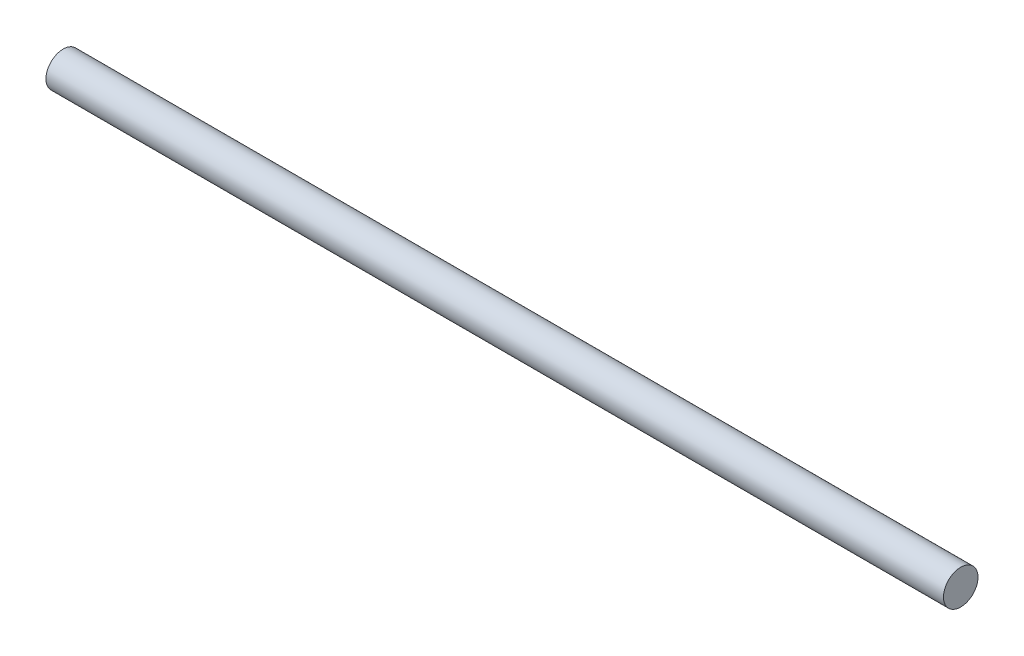
ISO-10303-21;
HEADER;
FILE_DESCRIPTION(('STEP AP214'),'2;1');
FILE_NAME('part.step','',(''),(''),'','','');
FILE_SCHEMA(('AUTOMOTIVE_DESIGN { 1 0 10303 214 1 1 1 1 }'));
ENDSEC;
DATA;
#1=APPLICATION_CONTEXT('core data for automotive mechanical design processes');
#2=APPLICATION_PROTOCOL_DEFINITION('international standard','automotive_design',2000,#1);
#3=PRODUCT_CONTEXT('',#1,'mechanical');
#4=PRODUCT('Part','Part','',(#3));
#5=PRODUCT_RELATED_PRODUCT_CATEGORY('part','',(#4));
#6=PRODUCT_DEFINITION_FORMATION('','',#4);
#7=PRODUCT_DEFINITION_CONTEXT('part definition',#1,'design');
#8=PRODUCT_DEFINITION('design','',#6,#7);
#9=PRODUCT_DEFINITION_SHAPE('','',#8);
#10=(LENGTH_UNIT() NAMED_UNIT(*) SI_UNIT(.MILLI.,.METRE.));
#11=(NAMED_UNIT(*) PLANE_ANGLE_UNIT() SI_UNIT($,.RADIAN.));
#12=(NAMED_UNIT(*) SI_UNIT($,.STERADIAN.) SOLID_ANGLE_UNIT());
#13=UNCERTAINTY_MEASURE_WITH_UNIT(LENGTH_MEASURE(1.E-05),#10,'distance_accuracy_value','');
#14=(GEOMETRIC_REPRESENTATION_CONTEXT(3) GLOBAL_UNCERTAINTY_ASSIGNED_CONTEXT((#13)) GLOBAL_UNIT_ASSIGNED_CONTEXT((#10,
#11,#12)) REPRESENTATION_CONTEXT('',''));
#15=CARTESIAN_POINT('',(0.,0.,0.));
#16=DIRECTION('',(0.,0.,1.));
#17=DIRECTION('',(1.,0.,0.));
#18=AXIS2_PLACEMENT_3D('',#15,#16,#17);
#19=CARTESIAN_POINT('',(520.,0.,0.));
#20=DIRECTION('',(-1.,0.,0.));
#21=DIRECTION('',(0.,0.,1.));
#22=AXIS2_PLACEMENT_3D('',#19,#20,#21);
#23=CYLINDRICAL_SURFACE('',#22,10.);
#24=CARTESIAN_POINT('',(520.,0.,0.));
#25=DIRECTION('',(1.,0.,0.));
#26=DIRECTION('',(0.,0.,-1.));
#27=AXIS2_PLACEMENT_3D('',#24,#25,#26);
#28=CIRCLE('',#27,10.);
#29=CARTESIAN_POINT('',(520.,0.,-10.));
#30=VERTEX_POINT('',#29);
#31=EDGE_CURVE('E10',#30,#30,#28,.T.);
#32=ORIENTED_EDGE('',*,*,#31,.F.);
#33=EDGE_LOOP('',(#32));
#34=FACE_BOUND('',#33,.T.);
#35=CARTESIAN_POINT('',(0.,0.,0.));
#36=DIRECTION('',(1.,0.,0.));
#37=DIRECTION('',(0.,0.,-1.));
#38=AXIS2_PLACEMENT_3D('',#35,#36,#37);
#39=CIRCLE('',#38,10.);
#40=CARTESIAN_POINT('',(0.,0.,-10.));
#41=VERTEX_POINT('',#40);
#42=EDGE_CURVE('E34',#41,#41,#39,.T.);
#43=ORIENTED_EDGE('',*,*,#42,.T.);
#44=EDGE_LOOP('',(#43));
#45=FACE_BOUND('',#44,.T.);
#46=ADVANCED_FACE('F31',(#34,#45),#23,.T.);
#47=CARTESIAN_POINT('',(520.,0.,0.));
#48=DIRECTION('',(1.,0.,0.));
#49=DIRECTION('',(0.,0.,-1.));
#50=AXIS2_PLACEMENT_3D('',#47,#48,#49);
#51=PLANE('',#50);
#52=ORIENTED_EDGE('',*,*,#31,.T.);
#53=EDGE_LOOP('',(#52));
#54=FACE_BOUND('',#53,.T.);
#55=ADVANCED_FACE('F46',(#54),#51,.T.);
#56=CARTESIAN_POINT('',(0.,0.,0.));
#57=DIRECTION('',(1.,0.,0.));
#58=DIRECTION('',(0.,0.,-1.));
#59=AXIS2_PLACEMENT_3D('',#56,#57,#58);
#60=PLANE('',#59);
#61=ORIENTED_EDGE('',*,*,#42,.F.);
#62=EDGE_LOOP('',(#61));
#63=FACE_BOUND('',#62,.T.);
#64=ADVANCED_FACE('F44',(#63),#60,.F.);
#65=CLOSED_SHELL('',(#46,#55,#64));
#66=MANIFOLD_SOLID_BREP('B2',#65);
#67=ADVANCED_BREP_SHAPE_REPRESENTATION('',(#18,#66),#14);
#68=SHAPE_DEFINITION_REPRESENTATION(#9,#67);
ENDSEC;
END-ISO-10303-21;
